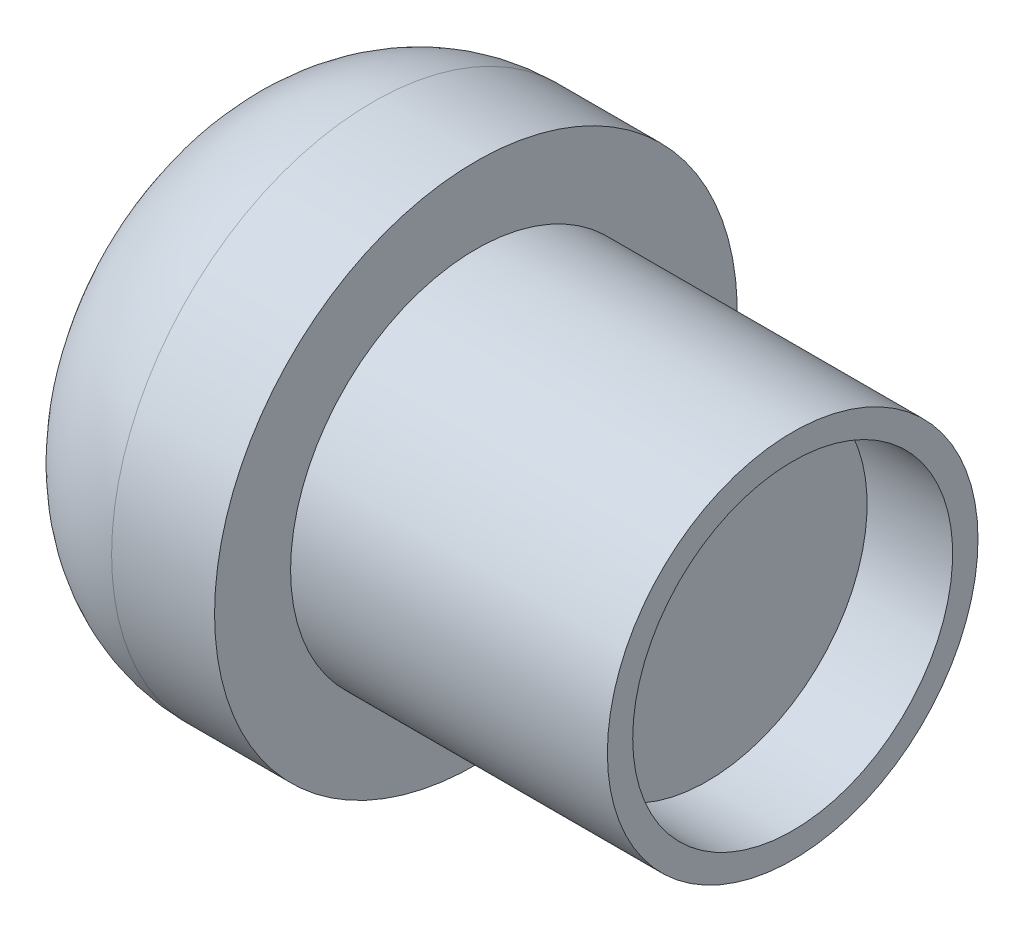
ISO-10303-21;
HEADER;
FILE_DESCRIPTION(('STEP AP214'),'2;1');
FILE_NAME('part.step','',(''),(''),'','','');
FILE_SCHEMA(('AUTOMOTIVE_DESIGN { 1 0 10303 214 1 1 1 1 }'));
ENDSEC;
DATA;
#1=APPLICATION_CONTEXT('core data for automotive mechanical design processes');
#2=APPLICATION_PROTOCOL_DEFINITION('international standard','automotive_design',2000,#1);
#3=PRODUCT_CONTEXT('',#1,'mechanical');
#4=PRODUCT('Part','Part','',(#3));
#5=PRODUCT_RELATED_PRODUCT_CATEGORY('part','',(#4));
#6=PRODUCT_DEFINITION_FORMATION('','',#4);
#7=PRODUCT_DEFINITION_CONTEXT('part definition',#1,'design');
#8=PRODUCT_DEFINITION('design','',#6,#7);
#9=PRODUCT_DEFINITION_SHAPE('','',#8);
#10=(LENGTH_UNIT() NAMED_UNIT(*) SI_UNIT(.MILLI.,.METRE.));
#11=(NAMED_UNIT(*) PLANE_ANGLE_UNIT() SI_UNIT($,.RADIAN.));
#12=(NAMED_UNIT(*) SI_UNIT($,.STERADIAN.) SOLID_ANGLE_UNIT());
#13=UNCERTAINTY_MEASURE_WITH_UNIT(LENGTH_MEASURE(1.E-05),#10,'distance_accuracy_value','');
#14=(GEOMETRIC_REPRESENTATION_CONTEXT(3) GLOBAL_UNCERTAINTY_ASSIGNED_CONTEXT((#13)) GLOBAL_UNIT_ASSIGNED_CONTEXT((#10,
#11,#12)) REPRESENTATION_CONTEXT('',''));
#15=CARTESIAN_POINT('',(0.,0.,0.));
#16=DIRECTION('',(0.,0.,1.));
#17=DIRECTION('',(1.,0.,0.));
#18=AXIS2_PLACEMENT_3D('',#15,#16,#17);
#19=CARTESIAN_POINT('',(0.,-0.8,0.));
#20=DIRECTION('',(-1.,0.,0.));
#21=DIRECTION('',(0.,0.,1.));
#22=AXIS2_PLACEMENT_3D('',#19,#20,#21);
#23=PLANE('',#22);
#24=CARTESIAN_POINT('',(0.,-5.85,0.));
#25=DIRECTION('',(-1.,0.,0.));
#26=DIRECTION('',(0.,0.,1.));
#27=AXIS2_PLACEMENT_3D('',#24,#25,#26);
#28=CIRCLE('',#27,5.85);
#29=CARTESIAN_POINT('',(0.,-5.85,5.85));
#30=VERTEX_POINT('',#29);
#31=EDGE_CURVE('E10',#30,#30,#28,.T.);
#32=ORIENTED_EDGE('',*,*,#31,.F.);
#33=EDGE_LOOP('',(#32));
#34=FACE_BOUND('',#33,.T.);
#35=CARTESIAN_POINT('',(0.,-5.85,0.));
#36=DIRECTION('',(-1.,0.,0.));
#37=DIRECTION('',(0.,0.,1.));
#38=AXIS2_PLACEMENT_3D('',#35,#36,#37);
#39=CIRCLE('',#38,5.05);
#40=CARTESIAN_POINT('',(0.,-5.85,5.05));
#41=VERTEX_POINT('',#40);
#42=EDGE_CURVE('E68',#41,#41,#39,.T.);
#43=ORIENTED_EDGE('',*,*,#42,.T.);
#44=EDGE_LOOP('',(#43));
#45=FACE_BOUND('',#44,.T.);
#46=ADVANCED_FACE('F37',(#34,#45),#23,.F.);
#47=CARTESIAN_POINT('',(-27.3029930845351,-5.85,0.));
#48=DIRECTION('',(-1.,0.,0.));
#49=DIRECTION('',(0.,0.,1.));
#50=AXIS2_PLACEMENT_3D('',#47,#48,#49);
#51=CYLINDRICAL_SURFACE('',#50,5.85);
#52=CARTESIAN_POINT('',(-10.,-5.85,0.));
#53=DIRECTION('',(-1.,0.,0.));
#54=DIRECTION('',(0.,0.,1.));
#55=AXIS2_PLACEMENT_3D('',#52,#53,#54);
#56=CIRCLE('',#55,5.85);
#57=CARTESIAN_POINT('',(-10.,-5.85,5.85));
#58=VERTEX_POINT('',#57);
#59=EDGE_CURVE('E44',#58,#58,#56,.T.);
#60=ORIENTED_EDGE('',*,*,#59,.F.);
#61=EDGE_LOOP('',(#60));
#62=FACE_BOUND('',#61,.T.);
#63=ORIENTED_EDGE('',*,*,#31,.T.);
#64=EDGE_LOOP('',(#63));
#65=FACE_BOUND('',#64,.T.);
#66=ADVANCED_FACE('F91',(#62,#65),#51,.T.);
#67=CARTESIAN_POINT('',(-10.,0.,0.));
#68=DIRECTION('',(-1.,0.,0.));
#69=DIRECTION('',(0.,0.,1.));
#70=AXIS2_PLACEMENT_3D('',#67,#68,#69);
#71=PLANE('',#70);
#72=CARTESIAN_POINT('',(-10.,-5.85,0.));
#73=DIRECTION('',(-1.,0.,0.));
#74=DIRECTION('',(0.,0.,1.));
#75=AXIS2_PLACEMENT_3D('',#72,#73,#74);
#76=CIRCLE('',#75,8.25);
#77=CARTESIAN_POINT('',(-10.,-5.85,8.25));
#78=VERTEX_POINT('',#77);
#79=EDGE_CURVE('E49',#78,#78,#76,.T.);
#80=ORIENTED_EDGE('',*,*,#79,.F.);
#81=EDGE_LOOP('',(#80));
#82=FACE_BOUND('',#81,.T.);
#83=ORIENTED_EDGE('',*,*,#59,.T.);
#84=EDGE_LOOP('',(#83));
#85=FACE_BOUND('',#84,.T.);
#86=ADVANCED_FACE('F96',(#82,#85),#71,.F.);
#87=CARTESIAN_POINT('',(-27.3029930845351,-5.85,0.));
#88=DIRECTION('',(-1.,0.,0.));
#89=DIRECTION('',(0.,0.,1.));
#90=AXIS2_PLACEMENT_3D('',#87,#88,#89);
#91=CYLINDRICAL_SURFACE('',#90,8.25);
#92=CARTESIAN_POINT('',(-13.25,-5.85,0.));
#93=DIRECTION('',(-1.,0.,0.));
#94=DIRECTION('',(0.,0.,1.));
#95=AXIS2_PLACEMENT_3D('',#92,#93,#94);
#96=CIRCLE('',#95,8.25);
#97=CARTESIAN_POINT('',(-13.25,-5.85,8.25));
#98=VERTEX_POINT('',#97);
#99=EDGE_CURVE('E54',#98,#98,#96,.T.);
#100=ORIENTED_EDGE('',*,*,#99,.F.);
#101=EDGE_LOOP('',(#100));
#102=FACE_BOUND('',#101,.T.);
#103=ORIENTED_EDGE('',*,*,#79,.T.);
#104=EDGE_LOOP('',(#103));
#105=FACE_BOUND('',#104,.T.);
#106=ADVANCED_FACE('F101',(#102,#105),#91,.T.);
#107=CARTESIAN_POINT('',(-13.25,-5.85,0.));
#108=DIRECTION('',(-1.,0.,0.));
#109=DIRECTION('',(0.,0.,1.));
#110=AXIS2_PLACEMENT_3D('',#107,#108,#109);
#111=DEGENERATE_TOROIDAL_SURFACE('',#110,3.25,5.,.T.);
#112=CARTESIAN_POINT('',(-18.25,-5.85,0.));
#113=DIRECTION('',(-1.,0.,0.));
#114=DIRECTION('',(0.,0.,1.));
#115=AXIS2_PLACEMENT_3D('',#112,#113,#114);
#116=CIRCLE('',#115,3.25);
#117=CARTESIAN_POINT('',(-18.25,-5.85,3.25));
#118=VERTEX_POINT('',#117);
#119=EDGE_CURVE('E60',#118,#118,#116,.T.);
#120=ORIENTED_EDGE('',*,*,#119,.F.);
#121=EDGE_LOOP('',(#120));
#122=FACE_BOUND('',#121,.T.);
#123=ORIENTED_EDGE('',*,*,#99,.T.);
#124=EDGE_LOOP('',(#123));
#125=FACE_BOUND('',#124,.T.);
#126=ADVANCED_FACE('F87',(#122,#125),#111,.T.);
#127=CARTESIAN_POINT('',(-18.25,-2.6,0.));
#128=DIRECTION('',(1.,0.,0.));
#129=DIRECTION('',(0.,0.,-1.));
#130=AXIS2_PLACEMENT_3D('',#127,#128,#129);
#131=PLANE('',#130);
#132=ORIENTED_EDGE('',*,*,#119,.T.);
#133=EDGE_LOOP('',(#132));
#134=FACE_BOUND('',#133,.T.);
#135=ADVANCED_FACE('F82',(#134),#131,.F.);
#136=CARTESIAN_POINT('',(-2.7,-0.800000000000001,0.));
#137=DIRECTION('',(-1.,0.,0.));
#138=DIRECTION('',(0.,0.,1.));
#139=AXIS2_PLACEMENT_3D('',#136,#137,#138);
#140=PLANE('',#139);
#141=CARTESIAN_POINT('',(-2.7,-5.85,0.));
#142=DIRECTION('',(-1.,0.,0.));
#143=DIRECTION('',(0.,0.,1.));
#144=AXIS2_PLACEMENT_3D('',#141,#142,#143);
#145=CIRCLE('',#144,5.05);
#146=CARTESIAN_POINT('',(-2.7,-5.85,5.05));
#147=VERTEX_POINT('',#146);
#148=EDGE_CURVE('E64',#147,#147,#145,.T.);
#149=ORIENTED_EDGE('',*,*,#148,.F.);
#150=EDGE_LOOP('',(#149));
#151=FACE_BOUND('',#150,.T.);
#152=ADVANCED_FACE('F77',(#151),#140,.F.);
#153=CARTESIAN_POINT('',(-27.3029930845351,-5.85,0.));
#154=DIRECTION('',(-1.,0.,0.));
#155=DIRECTION('',(0.,0.,1.));
#156=AXIS2_PLACEMENT_3D('',#153,#154,#155);
#157=CYLINDRICAL_SURFACE('',#156,5.05);
#158=ORIENTED_EDGE('',*,*,#42,.F.);
#159=EDGE_LOOP('',(#158));
#160=FACE_BOUND('',#159,.T.);
#161=ORIENTED_EDGE('',*,*,#148,.T.);
#162=EDGE_LOOP('',(#161));
#163=FACE_BOUND('',#162,.T.);
#164=ADVANCED_FACE('F74',(#160,#163),#157,.F.);
#165=CLOSED_SHELL('',(#46,#66,#86,#106,#126,#135,#152,#164));
#166=MANIFOLD_SOLID_BREP('B2',#165);
#167=ADVANCED_BREP_SHAPE_REPRESENTATION('',(#18,#166),#14);
#168=SHAPE_DEFINITION_REPRESENTATION(#9,#167);
ENDSEC;
END-ISO-10303-21;
